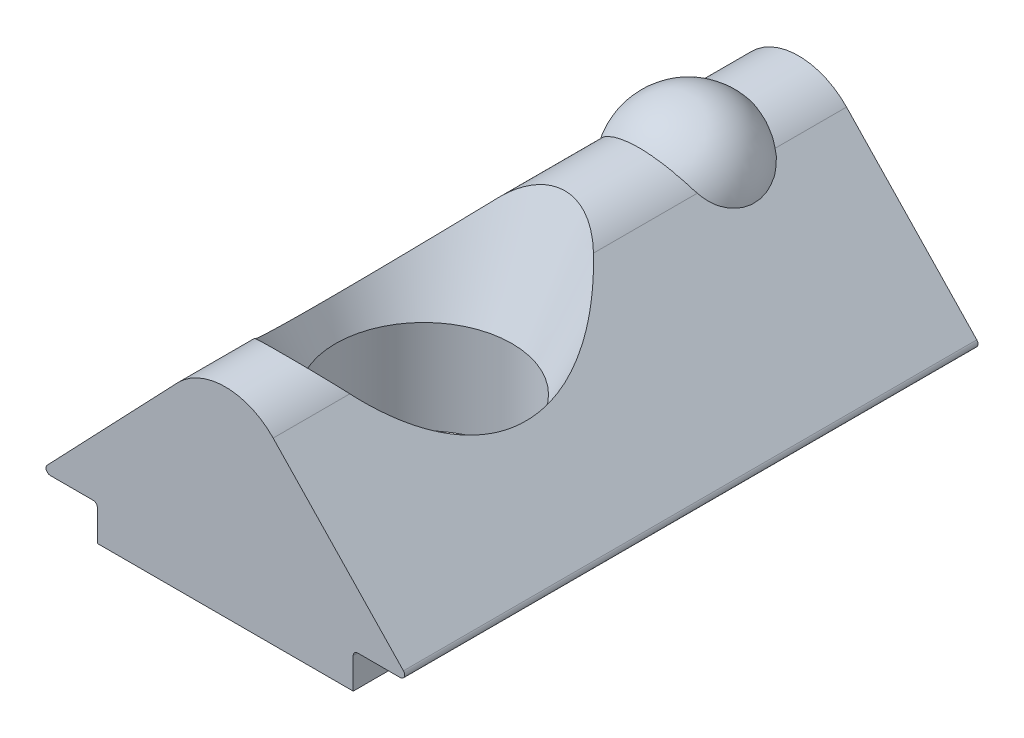
ISO-10303-21;
HEADER;
FILE_DESCRIPTION(('STEP AP214'),'2;1');
FILE_NAME('part.step','',(''),(''),'','','');
FILE_SCHEMA(('AUTOMOTIVE_DESIGN { 1 0 10303 214 1 1 1 1 }'));
ENDSEC;
DATA;
#1=APPLICATION_CONTEXT('core data for automotive mechanical design processes');
#2=APPLICATION_PROTOCOL_DEFINITION('international standard','automotive_design',2000,#1);
#3=PRODUCT_CONTEXT('',#1,'mechanical');
#4=PRODUCT('Part','Part','',(#3));
#5=PRODUCT_RELATED_PRODUCT_CATEGORY('part','',(#4));
#6=PRODUCT_DEFINITION_FORMATION('','',#4);
#7=PRODUCT_DEFINITION_CONTEXT('part definition',#1,'design');
#8=PRODUCT_DEFINITION('design','',#6,#7);
#9=PRODUCT_DEFINITION_SHAPE('','',#8);
#10=(LENGTH_UNIT() NAMED_UNIT(*) SI_UNIT(.MILLI.,.METRE.));
#11=(NAMED_UNIT(*) PLANE_ANGLE_UNIT() SI_UNIT($,.RADIAN.));
#12=(NAMED_UNIT(*) SI_UNIT($,.STERADIAN.) SOLID_ANGLE_UNIT());
#13=UNCERTAINTY_MEASURE_WITH_UNIT(LENGTH_MEASURE(1.E-05),#10,'distance_accuracy_value','');
#14=(GEOMETRIC_REPRESENTATION_CONTEXT(3) GLOBAL_UNCERTAINTY_ASSIGNED_CONTEXT((#13)) GLOBAL_UNIT_ASSIGNED_CONTEXT((#10,
#11,#12)) REPRESENTATION_CONTEXT('',''));
#15=CARTESIAN_POINT('',(0.,0.,0.));
#16=DIRECTION('',(0.,0.,1.));
#17=DIRECTION('',(1.,0.,0.));
#18=AXIS2_PLACEMENT_3D('',#15,#16,#17);
#19=CARTESIAN_POINT('',(0.,3.0263600030456,13.));
#20=DIRECTION('',(0.,0.,-1.));
#21=DIRECTION('',(-1.,0.,0.));
#22=AXIS2_PLACEMENT_3D('',#19,#20,#21);
#23=CYLINDRICAL_SURFACE('',#22,1.5);
#24=CARTESIAN_POINT('',(1.1275053061947,4.01566874378471,5.77975715322339));
#25=CARTESIAN_POINT('',(1.07713646526151,4.0730437690471,5.72782816923703));
#26=CARTESIAN_POINT('',(1.02134426156695,4.12780088185081,5.67750044078628));
#27=CARTESIAN_POINT('',(0.898374959297456,4.2302779365993,5.58232474976831));
#28=CARTESIAN_POINT('',(0.831092401189172,4.2779242491991,5.53753484899642));
#29=CARTESIAN_POINT('',(0.702102862678798,4.35349442790662,5.46599151700086));
#30=CARTESIAN_POINT('',(0.642598094597363,4.38344005630685,5.43745186569025));
#31=CARTESIAN_POINT('',(0.517790393693694,4.43577568212529,5.38737992610995));
#32=CARTESIAN_POINT('',(0.452507311951462,4.45819036916685,5.3658247482077));
#33=CARTESIAN_POINT('',(0.31662470360027,4.49426001322642,5.33106299382297));
#34=CARTESIAN_POINT('',(0.245978551481498,4.50782515588038,5.31794203560279));
#35=CARTESIAN_POINT('',(0.102297685694391,4.52461021762732,5.30169865680945));
#36=CARTESIAN_POINT('',(0.0292634481499037,4.52783218633575,5.29857425530728));
#37=CARTESIAN_POINT('',(-0.105853709858999,4.52392693502138,5.30235662721261));
#38=CARTESIAN_POINT('',(-0.168024142898928,4.51819940921376,5.30790674553975));
#39=CARTESIAN_POINT('',(-0.290093756436029,4.49933559825659,5.32614843083729));
#40=CARTESIAN_POINT('',(-0.349994164786748,4.48620338114536,5.33883607653686));
#41=CARTESIAN_POINT('',(-0.466454565594764,4.45328152831708,5.37054292575422));
#42=CARTESIAN_POINT('',(-0.522997502016885,4.43346083779321,5.38959165964446));
#43=CARTESIAN_POINT('',(-0.631738240886909,4.38811911386301,5.43297800984859));
#44=CARTESIAN_POINT('',(-0.683923629752147,4.36258251015175,5.45733006756589));
#45=CARTESIAN_POINT('',(-0.811676078112099,4.2909533647873,5.52526115570516));
#46=CARTESIAN_POINT('',(-0.883668434539245,4.24142830425813,5.57190002498299));
#47=CARTESIAN_POINT('',(-1.01493042604676,4.13407516819749,5.67173024658959));
#48=CARTESIAN_POINT('',(-1.07428742983025,4.0763090540148,5.72487231393841));
#49=CARTESIAN_POINT('',(-1.1275053061947,4.01566874378471,5.77975715322339));
#50=B_SPLINE_CURVE_WITH_KNOTS('',3,(#24,#25,#26,#27,#28,#29,#30,#31,#32,#33,#34,#35,#36,#37,#38,
#39,#40,#41,#42,#43,#44,#45,#46,#47,#48,#49),.UNSPECIFIED.,.F.,.F.,(4,2,2,2,2,2,2,2,2,2,2,2,4),
(0.,0.277486617325542,0.557672277304369,0.774246081706639,0.990102774484829,1.20811746208194,
1.42608894496533,1.61322219611575,1.8002527387921,1.98816390024299,2.17659330476716,
2.47215147923878,2.76559434826292),.UNSPECIFIED.);
#51=CARTESIAN_POINT('',(1.08483910898323,4.06227704008115,5.73741029552654));
#52=VERTEX_POINT('',#51);
#53=CARTESIAN_POINT('',(-1.08483910898321,4.06227704008115,5.73741029552654));
#54=VERTEX_POINT('',#53);
#55=EDGE_CURVE('P0_E33',#52,#54,#50,.T.);
#56=ORIENTED_EDGE('',*,*,#55,.F.);
#57=DIRECTION('',(0.,0.,-1.));
#58=VECTOR('',#57,1.);
#59=CARTESIAN_POINT('',(1.0848391089832,4.06227704008115,13.));
#60=LINE('',#59,#58);
#61=CARTESIAN_POINT('',(1.0848391089832,4.06227704008115,0.));
#62=VERTEX_POINT('',#61);
#63=EDGE_CURVE('P0_E137',#52,#62,#60,.T.);
#64=ORIENTED_EDGE('',*,*,#63,.T.);
#65=CARTESIAN_POINT('',(0.,3.0263600030456,0.));
#66=DIRECTION('',(0.,0.,1.));
#67=DIRECTION('',(1.,0.,0.));
#68=AXIS2_PLACEMENT_3D('',#65,#66,#67);
#69=CIRCLE('',#68,1.5);
#70=CARTESIAN_POINT('',(-1.08483910898321,4.06227704008115,0.));
#71=VERTEX_POINT('',#70);
#72=EDGE_CURVE('P0_E235',#62,#71,#69,.T.);
#73=ORIENTED_EDGE('',*,*,#72,.T.);
#74=DIRECTION('',(0.,0.,-1.));
#75=VECTOR('',#74,1.);
#76=CARTESIAN_POINT('',(-1.08483910898321,4.06227704008115,13.));
#77=LINE('',#76,#75);
#78=EDGE_CURVE('P0_E138',#54,#71,#77,.T.);
#79=ORIENTED_EDGE('',*,*,#78,.F.);
#80=EDGE_LOOP('',(#56,#64,#73,#79));
#81=FACE_BOUND('',#80,.T.);
#82=ADVANCED_FACE('P0_F17',(#81),#23,.T.);
#83=CARTESIAN_POINT('',(-1.1275053061947,4.01566874378471,11.2202428467766));
#84=CARTESIAN_POINT('',(-1.07713646526151,4.0730437690471,11.272171830763));
#85=CARTESIAN_POINT('',(-1.02134426156695,4.12780088185081,11.3224995592137));
#86=CARTESIAN_POINT('',(-0.898374959297457,4.2302779365993,11.4176752502317));
#87=CARTESIAN_POINT('',(-0.831092401189173,4.2779242491991,11.4624651510036));
#88=CARTESIAN_POINT('',(-0.702102862678799,4.35349442790662,11.5340084829991));
#89=CARTESIAN_POINT('',(-0.642598094597364,4.38344005630685,11.5625481343097));
#90=CARTESIAN_POINT('',(-0.517790393693696,4.43577568212529,11.6126200738901));
#91=CARTESIAN_POINT('',(-0.452507311951464,4.45819036916685,11.6341752517923));
#92=CARTESIAN_POINT('',(-0.316624703600272,4.49426001322642,11.668937006177));
#93=CARTESIAN_POINT('',(-0.2459785514815,4.50782515588038,11.6820579643972));
#94=CARTESIAN_POINT('',(-0.102297685694393,4.52461021762731,11.6983013431906));
#95=CARTESIAN_POINT('',(-0.029263448149906,4.52783218633575,11.7014257446927));
#96=CARTESIAN_POINT('',(0.105853709858997,4.52392693502138,11.6976433727874));
#97=CARTESIAN_POINT('',(0.168024142898925,4.51819940921376,11.6920932544603));
#98=CARTESIAN_POINT('',(0.290093756436026,4.49933559825659,11.6738515691627));
#99=CARTESIAN_POINT('',(0.349994164786746,4.48620338114536,11.6611639234631));
#100=CARTESIAN_POINT('',(0.466454565594762,4.45328152831708,11.6294570742458));
#101=CARTESIAN_POINT('',(0.522997502016882,4.43346083779321,11.6104083403555));
#102=CARTESIAN_POINT('',(0.631738240886906,4.38811911386301,11.5670219901514));
#103=CARTESIAN_POINT('',(0.683923629752144,4.36258251015175,11.5426699324341));
#104=CARTESIAN_POINT('',(0.811676078112096,4.2909533647873,11.4747388442948));
#105=CARTESIAN_POINT('',(0.883668434539243,4.24142830425813,11.428099975017));
#106=CARTESIAN_POINT('',(1.01493042604676,4.13407516819749,11.3282697534104));
#107=CARTESIAN_POINT('',(1.07428742983025,4.07630905401479,11.2751276860616));
#108=CARTESIAN_POINT('',(1.12750530619469,4.01566874378471,11.2202428467766));
#109=B_SPLINE_CURVE_WITH_KNOTS('',3,(#83,#84,#85,#86,#87,#88,#89,#90,#91,#92,#93,#94,#95,#96,
#97,#98,#99,#100,#101,#102,#103,#104,#105,#106,#107,#108),.UNSPECIFIED.,.F.,.F.,(4,2,2,2,2,2,2,
2,2,2,2,2,4),(0.,0.277486617325541,0.557672277304369,0.774246081706639,0.990102774484828,
1.20811746208193,1.42608894496533,1.61322219611575,1.8002527387921,1.98816390024299,
2.17659330476716,2.47215147923878,2.76559434826292),.UNSPECIFIED.);
#110=CARTESIAN_POINT('',(-1.08483910898321,4.06227704008115,11.2625897044735));
#111=VERTEX_POINT('',#110);
#112=CARTESIAN_POINT('',(1.08483910898323,4.06227704008115,11.2625897044735));
#113=VERTEX_POINT('',#112);
#114=EDGE_CURVE('P0_E121',#111,#113,#109,.T.);
#115=ORIENTED_EDGE('',*,*,#114,.F.);
#116=CARTESIAN_POINT('',(-1.08483910898321,4.06227704008115,13.));
#117=VERTEX_POINT('',#116);
#118=EDGE_CURVE('P0_E125',#117,#111,#77,.T.);
#119=ORIENTED_EDGE('',*,*,#118,.F.);
#120=CARTESIAN_POINT('',(0.,3.0263600030456,13.));
#121=DIRECTION('',(0.,0.,1.));
#122=DIRECTION('',(1.,0.,0.));
#123=AXIS2_PLACEMENT_3D('',#120,#121,#122);
#124=CIRCLE('',#123,1.5);
#125=CARTESIAN_POINT('',(1.0848391089832,4.06227704008115,13.));
#126=VERTEX_POINT('',#125);
#127=EDGE_CURVE('P0_E217',#126,#117,#124,.T.);
#128=ORIENTED_EDGE('',*,*,#127,.F.);
#129=EDGE_CURVE('P0_E127',#126,#113,#60,.T.);
#130=ORIENTED_EDGE('',*,*,#129,.T.);
#131=EDGE_LOOP('',(#115,#119,#128,#130));
#132=FACE_BOUND('',#131,.T.);
#133=ADVANCED_FACE('P0_F122',(#132),#23,.T.);
#134=CARTESIAN_POINT('',(0.,4.5263600030456,8.5));
#135=DIRECTION('',(0.,-1.,0.));
#136=DIRECTION('',(1.,0.,0.));
#137=AXIS2_PLACEMENT_3D('',#134,#135,#136);
#138=CYLINDRICAL_SURFACE('',#137,2.);
#139=CARTESIAN_POINT('',(0.,0.,8.5));
#140=DIRECTION('',(0.,-1.,0.));
#141=DIRECTION('',(1.,0.,0.));
#142=AXIS2_PLACEMENT_3D('',#139,#140,#141);
#143=CIRCLE('',#142,2.);
#144=CARTESIAN_POINT('',(2.,0.,8.5));
#145=VERTEX_POINT('',#144);
#146=EDGE_CURVE('P0_E229',#145,#145,#143,.T.);
#147=ORIENTED_EDGE('',*,*,#146,.T.);
#148=EDGE_LOOP('',(#147));
#149=FACE_BOUND('',#148,.T.);
#150=CARTESIAN_POINT('',(0.,2.1263600030456,8.5));
#151=DIRECTION('',(0.,1.,0.));
#152=DIRECTION('',(0.,0.,1.));
#153=AXIS2_PLACEMENT_3D('',#150,#151,#152);
#154=CIRCLE('',#153,2.);
#155=CARTESIAN_POINT('',(0.,2.1263600030456,10.5));
#156=VERTEX_POINT('',#155);
#157=EDGE_CURVE('P0_E21',#156,#156,#154,.F.);
#158=ORIENTED_EDGE('',*,*,#157,.F.);
#159=EDGE_LOOP('',(#158));
#160=FACE_BOUND('',#159,.T.);
#161=ADVANCED_FACE('P0_F268',(#149,#160),#138,.F.);
#162=CARTESIAN_POINT('',(-2.9,0.8,13.));
#163=DIRECTION('',(1.,0.,0.));
#164=DIRECTION('',(0.,1.,0.));
#165=AXIS2_PLACEMENT_3D('',#162,#163,#164);
#166=PLANE('',#165);
#167=DIRECTION('',(0.,-1.,0.));
#168=VECTOR('',#167,1.);
#169=CARTESIAN_POINT('',(-2.9,0.8,13.));
#170=LINE('',#169,#168);
#171=CARTESIAN_POINT('',(-2.9,0.7,13.));
#172=VERTEX_POINT('',#171);
#173=CARTESIAN_POINT('',(-2.9,0.,13.));
#174=VERTEX_POINT('',#173);
#175=EDGE_CURVE('P0_E240',#172,#174,#170,.T.);
#176=ORIENTED_EDGE('',*,*,#175,.F.);
#177=DIRECTION('',(0.,0.,-1.));
#178=VECTOR('',#177,1.);
#179=CARTESIAN_POINT('',(-2.9,0.7,0.));
#180=LINE('',#179,#178);
#181=CARTESIAN_POINT('',(-2.9,0.7,0.));
#182=VERTEX_POINT('',#181);
#183=EDGE_CURVE('P0_E152',#172,#182,#180,.T.);
#184=ORIENTED_EDGE('',*,*,#183,.T.);
#185=DIRECTION('',(0.,-1.,0.));
#186=VECTOR('',#185,1.);
#187=CARTESIAN_POINT('',(-2.9,0.8,0.));
#188=LINE('',#187,#186);
#189=CARTESIAN_POINT('',(-2.9,0.,0.));
#190=VERTEX_POINT('',#189);
#191=EDGE_CURVE('P0_E227',#182,#190,#188,.T.);
#192=ORIENTED_EDGE('',*,*,#191,.T.);
#193=DIRECTION('',(0.,0.,-1.));
#194=VECTOR('',#193,1.);
#195=CARTESIAN_POINT('',(-2.9,0.,13.));
#196=LINE('',#195,#194);
#197=EDGE_CURVE('P0_E149',#174,#190,#196,.T.);
#198=ORIENTED_EDGE('',*,*,#197,.F.);
#199=EDGE_LOOP('',(#176,#184,#192,#198));
#200=FACE_BOUND('',#199,.T.);
#201=ADVANCED_FACE('P0_F272',(#200),#166,.F.);
#202=CARTESIAN_POINT('',(-2.9,0.,13.));
#203=DIRECTION('',(0.,1.,0.));
#204=DIRECTION('',(-1.,0.,0.));
#205=AXIS2_PLACEMENT_3D('',#202,#203,#204);
#206=PLANE('',#205);
#207=ORIENTED_EDGE('',*,*,#146,.F.);
#208=EDGE_LOOP('',(#207));
#209=FACE_BOUND('',#208,.T.);
#210=DIRECTION('',(1.,0.,0.));
#211=VECTOR('',#210,1.);
#212=CARTESIAN_POINT('',(-2.9,0.,0.));
#213=LINE('',#212,#211);
#214=CARTESIAN_POINT('',(2.9,0.,0.));
#215=VERTEX_POINT('',#214);
#216=EDGE_CURVE('P0_E201',#190,#215,#213,.T.);
#217=ORIENTED_EDGE('',*,*,#216,.T.);
#218=DIRECTION('',(0.,0.,-1.));
#219=VECTOR('',#218,1.);
#220=CARTESIAN_POINT('',(2.9,0.,13.));
#221=LINE('',#220,#219);
#222=CARTESIAN_POINT('',(2.9,0.,13.));
#223=VERTEX_POINT('',#222);
#224=EDGE_CURVE('P0_E146',#223,#215,#221,.T.);
#225=ORIENTED_EDGE('',*,*,#224,.F.);
#226=DIRECTION('',(1.,0.,0.));
#227=VECTOR('',#226,1.);
#228=CARTESIAN_POINT('',(-2.9,0.,13.));
#229=LINE('',#228,#227);
#230=EDGE_CURVE('P0_E219',#174,#223,#229,.T.);
#231=ORIENTED_EDGE('',*,*,#230,.F.);
#232=ORIENTED_EDGE('',*,*,#197,.T.);
#233=EDGE_LOOP('',(#217,#225,#231,#232));
#234=FACE_BOUND('',#233,.T.);
#235=ADVANCED_FACE('P0_F308',(#209,#234),#206,.F.);
#236=CARTESIAN_POINT('',(2.9,0.,13.));
#237=DIRECTION('',(-1.,0.,0.));
#238=DIRECTION('',(0.,-1.,0.));
#239=AXIS2_PLACEMENT_3D('',#236,#237,#238);
#240=PLANE('',#239);
#241=DIRECTION('',(0.,1.,0.));
#242=VECTOR('',#241,1.);
#243=CARTESIAN_POINT('',(2.9,0.,0.));
#244=LINE('',#243,#242);
#245=CARTESIAN_POINT('',(2.9,0.700000000000001,0.));
#246=VERTEX_POINT('',#245);
#247=EDGE_CURVE('P0_E190',#215,#246,#244,.T.);
#248=ORIENTED_EDGE('',*,*,#247,.T.);
#249=DIRECTION('',(0.,0.,-1.));
#250=VECTOR('',#249,1.);
#251=CARTESIAN_POINT('',(2.9,0.700000000000001,13.));
#252=LINE('',#251,#250);
#253=CARTESIAN_POINT('',(2.9,0.700000000000001,13.));
#254=VERTEX_POINT('',#253);
#255=EDGE_CURVE('P0_E165',#246,#254,#252,.F.);
#256=ORIENTED_EDGE('',*,*,#255,.T.);
#257=DIRECTION('',(0.,1.,0.));
#258=VECTOR('',#257,1.);
#259=CARTESIAN_POINT('',(2.9,0.,13.));
#260=LINE('',#259,#258);
#261=EDGE_CURVE('P0_E211',#223,#254,#260,.T.);
#262=ORIENTED_EDGE('',*,*,#261,.F.);
#263=ORIENTED_EDGE('',*,*,#224,.T.);
#264=EDGE_LOOP('',(#248,#256,#262,#263));
#265=FACE_BOUND('',#264,.T.);
#266=ADVANCED_FACE('P0_F197',(#265),#240,.F.);
#267=CARTESIAN_POINT('',(2.9,0.800000000000001,13.));
#268=DIRECTION('',(0.,1.,0.));
#269=DIRECTION('',(-1.,0.,0.));
#270=AXIS2_PLACEMENT_3D('',#267,#268,#269);
#271=PLANE('',#270);
#272=DIRECTION('',(1.,0.,0.));
#273=VECTOR('',#272,1.);
#274=CARTESIAN_POINT('',(2.9,0.800000000000001,13.));
#275=LINE('',#274,#273);
#276=CARTESIAN_POINT('',(3.,0.800000000000001,13.));
#277=VERTEX_POINT('',#276);
#278=CARTESIAN_POINT('',(3.96624026401367,0.800000000000001,13.));
#279=VERTEX_POINT('',#278);
#280=EDGE_CURVE('P0_E209',#277,#279,#275,.T.);
#281=ORIENTED_EDGE('',*,*,#280,.F.);
#282=DIRECTION('',(0.,0.,-1.));
#283=VECTOR('',#282,1.);
#284=CARTESIAN_POINT('',(3.,0.800000000000001,0.));
#285=LINE('',#284,#283);
#286=CARTESIAN_POINT('',(3.,0.800000000000001,0.));
#287=VERTEX_POINT('',#286);
#288=EDGE_CURVE('P0_E162',#277,#287,#285,.T.);
#289=ORIENTED_EDGE('',*,*,#288,.T.);
#290=DIRECTION('',(1.,0.,0.));
#291=VECTOR('',#290,1.);
#292=CARTESIAN_POINT('',(2.9,0.800000000000001,0.));
#293=LINE('',#292,#291);
#294=CARTESIAN_POINT('',(3.96624026401367,0.800000000000001,0.));
#295=VERTEX_POINT('',#294);
#296=EDGE_CURVE('P0_E192',#287,#295,#293,.T.);
#297=ORIENTED_EDGE('',*,*,#296,.T.);
#298=DIRECTION('',(0.,0.,-1.));
#299=VECTOR('',#298,1.);
#300=CARTESIAN_POINT('',(3.96624026401367,0.800000000000001,13.));
#301=LINE('',#300,#299);
#302=EDGE_CURVE('P0_E160',#295,#279,#301,.F.);
#303=ORIENTED_EDGE('',*,*,#302,.T.);
#304=EDGE_LOOP('',(#281,#289,#297,#303));
#305=FACE_BOUND('',#304,.T.);
#306=ADVANCED_FACE('P0_F213',(#305),#271,.F.);
#307=CARTESIAN_POINT('',(4.2,0.800000000000002,13.));
#308=DIRECTION('',(-0.72322607265547,-0.690611358023704,0.));
#309=DIRECTION('',(0.690611358023704,-0.72322607265547,0.));
#310=AXIS2_PLACEMENT_3D('',#307,#308,#309);
#311=PLANE('',#310);
#312=CARTESIAN_POINT('',(-2.55086399119041,7.86967934230282,8.5));
#313=DIRECTION('',(-0.72322607265547,-0.690611358023704,0.));
#314=DIRECTION('',(-0.690611358023704,0.72322607265547,0.));
#315=AXIS2_PLACEMENT_3D('',#312,#313,#314);
#316=ELLIPSE('',#315,7.05412619272531,4.15044104103818);
#317=EDGE_CURVE('P0_E129',#113,#52,#316,.F.);
#318=ORIENTED_EDGE('',*,*,#317,.F.);
#319=ORIENTED_EDGE('',*,*,#129,.F.);
#320=DIRECTION('',(-0.690611358023704,0.72322607265547,0.));
#321=VECTOR('',#320,1.);
#322=CARTESIAN_POINT('',(4.2,0.800000000000002,13.));
#323=LINE('',#322,#321);
#324=CARTESIAN_POINT('',(4.03856287127922,0.969061135802372,13.));
#325=VERTEX_POINT('',#324);
#326=EDGE_CURVE('P0_E215',#325,#126,#323,.T.);
#327=ORIENTED_EDGE('',*,*,#326,.F.);
#328=DIRECTION('',(0.,0.,-1.));
#329=VECTOR('',#328,1.);
#330=CARTESIAN_POINT('',(4.03856287127922,0.969061135802372,13.));
#331=LINE('',#330,#329);
#332=CARTESIAN_POINT('',(4.03856287127922,0.969061135802372,0.));
#333=VERTEX_POINT('',#332);
#334=EDGE_CURVE('P0_E167',#325,#333,#331,.T.);
#335=ORIENTED_EDGE('',*,*,#334,.T.);
#336=DIRECTION('',(-0.690611358023704,0.72322607265547,0.));
#337=VECTOR('',#336,1.);
#338=CARTESIAN_POINT('',(4.2,0.800000000000002,0.));
#339=LINE('',#338,#337);
#340=EDGE_CURVE('P0_E232',#333,#62,#339,.T.);
#341=ORIENTED_EDGE('',*,*,#340,.T.);
#342=ORIENTED_EDGE('',*,*,#63,.F.);
#343=EDGE_LOOP('',(#318,#319,#327,#335,#341,#342));
#344=FACE_BOUND('',#343,.T.);
#345=ADVANCED_FACE('P0_F282',(#344),#311,.F.);
#346=CARTESIAN_POINT('',(-1.08483910898321,4.06227704008115,13.));
#347=DIRECTION('',(0.723226072655471,-0.690611358023704,0.));
#348=DIRECTION('',(0.690611358023704,0.723226072655471,0.));
#349=AXIS2_PLACEMENT_3D('',#346,#347,#348);
#350=PLANE('',#349);
#351=CARTESIAN_POINT('',(2.55086399119041,7.86967934230282,8.5));
#352=DIRECTION('',(0.723226072655471,-0.690611358023704,0.));
#353=DIRECTION('',(0.690611358023704,0.723226072655471,0.));
#354=AXIS2_PLACEMENT_3D('',#351,#352,#353);
#355=ELLIPSE('',#354,7.05412619272532,4.15044104103818);
#356=EDGE_CURVE('P0_E131',#54,#111,#355,.F.);
#357=ORIENTED_EDGE('',*,*,#356,.F.);
#358=ORIENTED_EDGE('',*,*,#78,.T.);
#359=DIRECTION('',(-0.690611358023704,-0.723226072655471,0.));
#360=VECTOR('',#359,1.);
#361=CARTESIAN_POINT('',(-1.08483910898321,4.06227704008115,0.));
#362=LINE('',#361,#360);
#363=CARTESIAN_POINT('',(-4.03856287127922,0.969061135802369,0.));
#364=VERTEX_POINT('',#363);
#365=EDGE_CURVE('P0_E237',#71,#364,#362,.T.);
#366=ORIENTED_EDGE('',*,*,#365,.T.);
#367=DIRECTION('',(0.,0.,-1.));
#368=VECTOR('',#367,1.);
#369=CARTESIAN_POINT('',(-4.03856287127922,0.96906113580237,13.));
#370=LINE('',#369,#368);
#371=CARTESIAN_POINT('',(-4.03856287127922,0.969061135802369,13.));
#372=VERTEX_POINT('',#371);
#373=EDGE_CURVE('P0_E41',#364,#372,#370,.F.);
#374=ORIENTED_EDGE('',*,*,#373,.T.);
#375=DIRECTION('',(-0.690611358023704,-0.723226072655471,0.));
#376=VECTOR('',#375,1.);
#377=CARTESIAN_POINT('',(-1.08483910898321,4.06227704008115,13.));
#378=LINE('',#377,#376);
#379=EDGE_CURVE('P0_E136',#117,#372,#378,.T.);
#380=ORIENTED_EDGE('',*,*,#379,.F.);
#381=ORIENTED_EDGE('',*,*,#118,.T.);
#382=EDGE_LOOP('',(#357,#358,#366,#374,#380,#381));
#383=FACE_BOUND('',#382,.T.);
#384=ADVANCED_FACE('P0_F135',(#383),#350,.F.);
#385=CARTESIAN_POINT('',(-4.2,0.8,13.));
#386=DIRECTION('',(0.,1.,0.));
#387=DIRECTION('',(-1.,0.,0.));
#388=AXIS2_PLACEMENT_3D('',#385,#386,#387);
#389=PLANE('',#388);
#390=DIRECTION('',(1.,0.,0.));
#391=VECTOR('',#390,1.);
#392=CARTESIAN_POINT('',(-4.2,0.8,0.));
#393=LINE('',#392,#391);
#394=CARTESIAN_POINT('',(-3.96624026401368,0.8,0.));
#395=VERTEX_POINT('',#394);
#396=CARTESIAN_POINT('',(-3.,0.8,0.));
#397=VERTEX_POINT('',#396);
#398=EDGE_CURVE('P0_E143',#395,#397,#393,.T.);
#399=ORIENTED_EDGE('',*,*,#398,.T.);
#400=DIRECTION('',(0.,0.,-1.));
#401=VECTOR('',#400,1.);
#402=CARTESIAN_POINT('',(-3.,0.8,13.));
#403=LINE('',#402,#401);
#404=CARTESIAN_POINT('',(-3.,0.8,13.));
#405=VERTEX_POINT('',#404);
#406=EDGE_CURVE('P0_E158',#397,#405,#403,.F.);
#407=ORIENTED_EDGE('',*,*,#406,.T.);
#408=DIRECTION('',(1.,0.,0.));
#409=VECTOR('',#408,1.);
#410=CARTESIAN_POINT('',(-4.2,0.8,13.));
#411=LINE('',#410,#409);
#412=CARTESIAN_POINT('',(-3.96624026401368,0.8,13.));
#413=VERTEX_POINT('',#412);
#414=EDGE_CURVE('P0_E141',#413,#405,#411,.T.);
#415=ORIENTED_EDGE('',*,*,#414,.F.);
#416=DIRECTION('',(0.,0.,-1.));
#417=VECTOR('',#416,1.);
#418=CARTESIAN_POINT('',(-3.96624026401368,0.8,13.));
#419=LINE('',#418,#417);
#420=EDGE_CURVE('P0_E155',#413,#395,#419,.T.);
#421=ORIENTED_EDGE('',*,*,#420,.T.);
#422=EDGE_LOOP('',(#399,#407,#415,#421));
#423=FACE_BOUND('',#422,.T.);
#424=ADVANCED_FACE('P0_F276',(#423),#389,.F.);
#425=CARTESIAN_POINT('',(0.,3.0263600030456,13.));
#426=DIRECTION('',(0.,0.,1.));
#427=DIRECTION('',(1.,0.,0.));
#428=AXIS2_PLACEMENT_3D('',#425,#426,#427);
#429=PLANE('',#428);
#430=ORIENTED_EDGE('',*,*,#280,.T.);
#431=CARTESIAN_POINT('',(3.96624026401367,0.900000000000001,13.));
#432=DIRECTION('',(0.,0.,1.));
#433=DIRECTION('',(1.,0.,0.));
#434=AXIS2_PLACEMENT_3D('',#431,#432,#433);
#435=CIRCLE('',#434,0.1);
#436=EDGE_CURVE('P0_E176',#279,#325,#435,.T.);
#437=ORIENTED_EDGE('',*,*,#436,.T.);
#438=ORIENTED_EDGE('',*,*,#326,.T.);
#439=ORIENTED_EDGE('',*,*,#127,.T.);
#440=ORIENTED_EDGE('',*,*,#379,.T.);
#441=CARTESIAN_POINT('',(-3.96624026401368,0.9,13.));
#442=DIRECTION('',(0.,0.,1.));
#443=DIRECTION('',(1.,0.,0.));
#444=AXIS2_PLACEMENT_3D('',#441,#442,#443);
#445=CIRCLE('',#444,0.1);
#446=EDGE_CURVE('P0_E174',#372,#413,#445,.T.);
#447=ORIENTED_EDGE('',*,*,#446,.T.);
#448=ORIENTED_EDGE('',*,*,#414,.T.);
#449=CARTESIAN_POINT('',(-3.,0.7,13.));
#450=DIRECTION('',(0.,0.,1.));
#451=DIRECTION('',(1.,0.,0.));
#452=AXIS2_PLACEMENT_3D('',#449,#450,#451);
#453=CIRCLE('',#452,0.1);
#454=EDGE_CURVE('P0_E181',#405,#172,#453,.F.);
#455=ORIENTED_EDGE('',*,*,#454,.T.);
#456=ORIENTED_EDGE('',*,*,#175,.T.);
#457=ORIENTED_EDGE('',*,*,#230,.T.);
#458=ORIENTED_EDGE('',*,*,#261,.T.);
#459=CARTESIAN_POINT('',(3.,0.700000000000001,13.));
#460=DIRECTION('',(0.,0.,1.));
#461=DIRECTION('',(1.,0.,0.));
#462=AXIS2_PLACEMENT_3D('',#459,#460,#461);
#463=CIRCLE('',#462,0.1);
#464=EDGE_CURVE('P0_E11',#254,#277,#463,.F.);
#465=ORIENTED_EDGE('',*,*,#464,.T.);
#466=EDGE_LOOP('',(#430,#437,#438,#439,#440,#447,#448,#455,#456,#457,#458,#465));
#467=FACE_BOUND('',#466,.T.);
#468=ADVANCED_FACE('P0_F208',(#467),#429,.T.);
#469=CARTESIAN_POINT('',(0.,3.0263600030456,0.));
#470=DIRECTION('',(0.,0.,1.));
#471=DIRECTION('',(1.,0.,0.));
#472=AXIS2_PLACEMENT_3D('',#469,#470,#471);
#473=PLANE('',#472);
#474=ORIENTED_EDGE('',*,*,#340,.F.);
#475=CARTESIAN_POINT('',(3.96624026401367,0.900000000000001,0.));
#476=DIRECTION('',(0.,0.,1.));
#477=DIRECTION('',(1.,0.,0.));
#478=AXIS2_PLACEMENT_3D('',#475,#476,#477);
#479=CIRCLE('',#478,0.1);
#480=EDGE_CURVE('P0_E172',#333,#295,#479,.F.);
#481=ORIENTED_EDGE('',*,*,#480,.T.);
#482=ORIENTED_EDGE('',*,*,#296,.F.);
#483=CARTESIAN_POINT('',(3.,0.700000000000001,0.));
#484=DIRECTION('',(0.,0.,1.));
#485=DIRECTION('',(1.,0.,0.));
#486=AXIS2_PLACEMENT_3D('',#483,#484,#485);
#487=CIRCLE('',#486,0.1);
#488=EDGE_CURVE('P0_E26',#287,#246,#487,.T.);
#489=ORIENTED_EDGE('',*,*,#488,.T.);
#490=ORIENTED_EDGE('',*,*,#247,.F.);
#491=ORIENTED_EDGE('',*,*,#216,.F.);
#492=ORIENTED_EDGE('',*,*,#191,.F.);
#493=CARTESIAN_POINT('',(-3.,0.7,0.));
#494=DIRECTION('',(0.,0.,1.));
#495=DIRECTION('',(1.,0.,0.));
#496=AXIS2_PLACEMENT_3D('',#493,#494,#495);
#497=CIRCLE('',#496,0.1);
#498=EDGE_CURVE('P0_E179',#182,#397,#497,.T.);
#499=ORIENTED_EDGE('',*,*,#498,.T.);
#500=ORIENTED_EDGE('',*,*,#398,.F.);
#501=CARTESIAN_POINT('',(-3.96624026401368,0.9,0.));
#502=DIRECTION('',(0.,0.,1.));
#503=DIRECTION('',(1.,0.,0.));
#504=AXIS2_PLACEMENT_3D('',#501,#502,#503);
#505=CIRCLE('',#504,0.1);
#506=EDGE_CURVE('P0_E170',#395,#364,#505,.F.);
#507=ORIENTED_EDGE('',*,*,#506,.T.);
#508=ORIENTED_EDGE('',*,*,#365,.F.);
#509=ORIENTED_EDGE('',*,*,#72,.F.);
#510=EDGE_LOOP('',(#474,#481,#482,#489,#490,#491,#492,#499,#500,#507,#508,#509));
#511=FACE_BOUND('',#510,.T.);
#512=ADVANCED_FACE('P0_F188',(#511),#473,.F.);
#513=CARTESIAN_POINT('',(-3.,0.7,13.));
#514=DIRECTION('',(0.,0.,1.));
#515=DIRECTION('',(1.,0.,0.));
#516=AXIS2_PLACEMENT_3D('',#513,#514,#515);
#517=CYLINDRICAL_SURFACE('',#516,0.1);
#518=ORIENTED_EDGE('',*,*,#454,.F.);
#519=ORIENTED_EDGE('',*,*,#406,.F.);
#520=ORIENTED_EDGE('',*,*,#498,.F.);
#521=ORIENTED_EDGE('',*,*,#183,.F.);
#522=EDGE_LOOP('',(#518,#519,#520,#521));
#523=FACE_BOUND('',#522,.T.);
#524=ADVANCED_FACE('P0_F279',(#523),#517,.F.);
#525=CARTESIAN_POINT('',(3.,0.700000000000001,13.));
#526=DIRECTION('',(0.,0.,1.));
#527=DIRECTION('',(1.,0.,0.));
#528=AXIS2_PLACEMENT_3D('',#525,#526,#527);
#529=CYLINDRICAL_SURFACE('',#528,0.1);
#530=ORIENTED_EDGE('',*,*,#464,.F.);
#531=ORIENTED_EDGE('',*,*,#255,.F.);
#532=ORIENTED_EDGE('',*,*,#488,.F.);
#533=ORIENTED_EDGE('',*,*,#288,.F.);
#534=EDGE_LOOP('',(#530,#531,#532,#533));
#535=FACE_BOUND('',#534,.T.);
#536=ADVANCED_FACE('P0_F204',(#535),#529,.F.);
#537=CARTESIAN_POINT('',(3.96624026401367,0.900000000000001,13.));
#538=DIRECTION('',(0.,0.,-1.));
#539=DIRECTION('',(-1.,0.,0.));
#540=AXIS2_PLACEMENT_3D('',#537,#538,#539);
#541=CYLINDRICAL_SURFACE('',#540,0.1);
#542=ORIENTED_EDGE('',*,*,#436,.F.);
#543=ORIENTED_EDGE('',*,*,#302,.F.);
#544=ORIENTED_EDGE('',*,*,#480,.F.);
#545=ORIENTED_EDGE('',*,*,#334,.F.);
#546=EDGE_LOOP('',(#542,#543,#544,#545));
#547=FACE_BOUND('',#546,.T.);
#548=ADVANCED_FACE('P0_F324',(#547),#541,.T.);
#549=CARTESIAN_POINT('',(-3.96624026401368,0.9,13.));
#550=DIRECTION('',(0.,0.,-1.));
#551=DIRECTION('',(-1.,0.,0.));
#552=AXIS2_PLACEMENT_3D('',#549,#550,#551);
#553=CYLINDRICAL_SURFACE('',#552,0.1);
#554=ORIENTED_EDGE('',*,*,#446,.F.);
#555=ORIENTED_EDGE('',*,*,#373,.F.);
#556=ORIENTED_EDGE('',*,*,#506,.F.);
#557=ORIENTED_EDGE('',*,*,#420,.F.);
#558=EDGE_LOOP('',(#554,#555,#556,#557));
#559=FACE_BOUND('',#558,.T.);
#560=ADVANCED_FACE('P0_F19',(#559),#553,.T.);
#561=CARTESIAN_POINT('',(0.,4.5263600030456,8.5));
#562=DIRECTION('',(0.,1.,0.));
#563=DIRECTION('',(0.,0.,1.));
#564=AXIS2_PLACEMENT_3D('',#561,#562,#563);
#565=CONICAL_SURFACE('',#564,3.2,0.463647609000806);
#566=ORIENTED_EDGE('',*,*,#157,.T.);
#567=EDGE_LOOP('',(#566));
#568=FACE_BOUND('',#567,.T.);
#569=ORIENTED_EDGE('',*,*,#317,.T.);
#570=ORIENTED_EDGE('',*,*,#55,.T.);
#571=ORIENTED_EDGE('',*,*,#356,.T.);
#572=ORIENTED_EDGE('',*,*,#114,.T.);
#573=EDGE_LOOP('',(#569,#570,#571,#572));
#574=FACE_BOUND('',#573,.T.);
#575=ADVANCED_FACE('P0_F132',(#568,#574),#565,.F.);
#576=CLOSED_SHELL('',(#82,#133,#161,#201,#235,#266,#306,#345,#384,#424,#468,#512,#524,#536,#548,
#560,#575));
#577=MANIFOLD_SOLID_BREP('P0_B1',#576);
#578=CARTESIAN_POINT('',(0.,3.5263600030456,2.5));
#579=DIRECTION('',(0.,1.,0.));
#580=DIRECTION('',(0.,0.,-1.));
#581=AXIS2_PLACEMENT_3D('',#578,#579,#580);
#582=SPHERICAL_SURFACE('',#581,1.5);
#583=CARTESIAN_POINT('',(0.,5.0263600030456,2.5));
#584=VERTEX_POINT('',#583);
#585=VERTEX_LOOP('',#584);
#586=FACE_BOUND('',#585,.T.);
#587=ADVANCED_FACE('P1_F12',(#586),#582,.T.);
#588=CLOSED_SHELL('',(#587));
#589=MANIFOLD_SOLID_BREP('P1_B1',#588);
#590=ADVANCED_BREP_SHAPE_REPRESENTATION('',(#18,#577,#589),#14);
#591=SHAPE_DEFINITION_REPRESENTATION(#9,#590);
ENDSEC;
END-ISO-10303-21;
